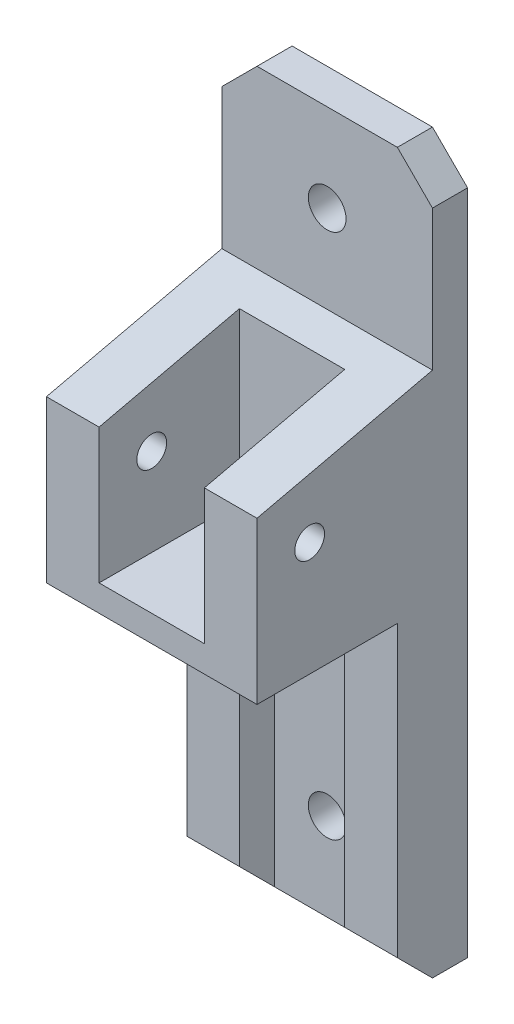
ISO-10303-21;
HEADER;
FILE_DESCRIPTION(('STEP AP214'),'2;1');
FILE_NAME('part.step','',(''),(''),'','','');
FILE_SCHEMA(('AUTOMOTIVE_DESIGN { 1 0 10303 214 1 1 1 1 }'));
ENDSEC;
DATA;
#1=APPLICATION_CONTEXT('core data for automotive mechanical design processes');
#2=APPLICATION_PROTOCOL_DEFINITION('international standard','automotive_design',2000,#1);
#3=PRODUCT_CONTEXT('',#1,'mechanical');
#4=PRODUCT('Part','Part','',(#3));
#5=PRODUCT_RELATED_PRODUCT_CATEGORY('part','',(#4));
#6=PRODUCT_DEFINITION_FORMATION('','',#4);
#7=PRODUCT_DEFINITION_CONTEXT('part definition',#1,'design');
#8=PRODUCT_DEFINITION('design','',#6,#7);
#9=PRODUCT_DEFINITION_SHAPE('','',#8);
#10=(LENGTH_UNIT() NAMED_UNIT(*) SI_UNIT(.MILLI.,.METRE.));
#11=(NAMED_UNIT(*) PLANE_ANGLE_UNIT() SI_UNIT($,.RADIAN.));
#12=(NAMED_UNIT(*) SI_UNIT($,.STERADIAN.) SOLID_ANGLE_UNIT());
#13=UNCERTAINTY_MEASURE_WITH_UNIT(LENGTH_MEASURE(1.E-05),#10,'distance_accuracy_value','');
#14=(GEOMETRIC_REPRESENTATION_CONTEXT(3) GLOBAL_UNCERTAINTY_ASSIGNED_CONTEXT((#13)) GLOBAL_UNIT_ASSIGNED_CONTEXT((#10,
#11,#12)) REPRESENTATION_CONTEXT('',''));
#15=CARTESIAN_POINT('',(0.,0.,0.));
#16=DIRECTION('',(0.,0.,1.));
#17=DIRECTION('',(1.,0.,0.));
#18=AXIS2_PLACEMENT_3D('',#15,#16,#17);
#19=CARTESIAN_POINT('',(12.,10.,18.));
#20=DIRECTION('',(1.,0.,0.));
#21=DIRECTION('',(0.,0.,-1.));
#22=AXIS2_PLACEMENT_3D('',#19,#20,#21);
#23=CYLINDRICAL_SURFACE('',#22,1.69999999999999);
#24=CARTESIAN_POINT('',(-6.,10.,18.));
#25=DIRECTION('',(-1.,0.,0.));
#26=DIRECTION('',(0.,-1.,0.));
#27=AXIS2_PLACEMENT_3D('',#24,#25,#26);
#28=CIRCLE('',#27,1.69999999999999);
#29=CARTESIAN_POINT('',(-6.,8.3,18.));
#30=VERTEX_POINT('',#29);
#31=EDGE_CURVE('E363',#30,#30,#28,.T.);
#32=ORIENTED_EDGE('',*,*,#31,.F.);
#33=EDGE_LOOP('',(#32));
#34=FACE_BOUND('',#33,.T.);
#35=CARTESIAN_POINT('',(-9.,10.,18.));
#36=DIRECTION('',(-1.,0.,0.));
#37=DIRECTION('',(0.,-1.,0.));
#38=AXIS2_PLACEMENT_3D('',#35,#36,#37);
#39=CIRCLE('',#38,1.69999999999999);
#40=CARTESIAN_POINT('',(-9.,8.3,18.));
#41=VERTEX_POINT('',#40);
#42=EDGE_CURVE('E45',#41,#41,#39,.F.);
#43=ORIENTED_EDGE('',*,*,#42,.F.);
#44=EDGE_LOOP('',(#43));
#45=FACE_BOUND('',#44,.T.);
#46=ADVANCED_FACE('F41',(#34,#45),#23,.F.);
#47=CARTESIAN_POINT('',(0.,0.,4.));
#48=DIRECTION('',(0.,0.,1.));
#49=DIRECTION('',(1.,0.,0.));
#50=AXIS2_PLACEMENT_3D('',#47,#48,#49);
#51=PLANE('',#50);
#52=CARTESIAN_POINT('',(0.,-30.,4.));
#53=DIRECTION('',(0.,0.,1.));
#54=DIRECTION('',(1.,0.,0.));
#55=AXIS2_PLACEMENT_3D('',#52,#53,#54);
#56=CIRCLE('',#55,2.14999999999999);
#57=CARTESIAN_POINT('',(2.15,-30.,4.));
#58=VERTEX_POINT('',#57);
#59=EDGE_CURVE('E385',#58,#58,#56,.T.);
#60=ORIENTED_EDGE('',*,*,#59,.F.);
#61=EDGE_LOOP('',(#60));
#62=FACE_BOUND('',#61,.T.);
#63=DIRECTION('',(1.,0.,0.));
#64=VECTOR('',#63,1.);
#65=CARTESIAN_POINT('',(-12.,-40.,4.));
#66=LINE('',#65,#64);
#67=CARTESIAN_POINT('',(-5.99999999999999,-40.,4.));
#68=VERTEX_POINT('',#67);
#69=CARTESIAN_POINT('',(6.,-40.,4.));
#70=VERTEX_POINT('',#69);
#71=EDGE_CURVE('E283',#68,#70,#66,.T.);
#72=ORIENTED_EDGE('',*,*,#71,.T.);
#73=DIRECTION('',(0.,-1.,0.));
#74=VECTOR('',#73,1.);
#75=CARTESIAN_POINT('',(6.,-3.,4.));
#76=LINE('',#75,#74);
#77=CARTESIAN_POINT('',(6.00000000000001,-3.,4.));
#78=VERTEX_POINT('',#77);
#79=EDGE_CURVE('E374',#78,#70,#76,.T.);
#80=ORIENTED_EDGE('',*,*,#79,.F.);
#81=DIRECTION('',(1.,0.,0.));
#82=VECTOR('',#81,1.);
#83=CARTESIAN_POINT('',(-12.,-3.00000000000001,4.));
#84=LINE('',#83,#82);
#85=CARTESIAN_POINT('',(-5.99999999999999,-3.,4.));
#86=VERTEX_POINT('',#85);
#87=EDGE_CURVE('E258',#86,#78,#84,.T.);
#88=ORIENTED_EDGE('',*,*,#87,.F.);
#89=DIRECTION('',(0.,1.,0.));
#90=VECTOR('',#89,1.);
#91=CARTESIAN_POINT('',(-5.99999999999999,-40.,4.));
#92=LINE('',#91,#90);
#93=EDGE_CURVE('E233',#68,#86,#92,.T.);
#94=ORIENTED_EDGE('',*,*,#93,.F.);
#95=EDGE_LOOP('',(#72,#80,#88,#94));
#96=FACE_BOUND('',#95,.T.);
#97=ADVANCED_FACE('F529',(#62,#96),#51,.T.);
#98=CARTESIAN_POINT('',(-12.,-3.00000000000001,8.));
#99=DIRECTION('',(0.,1.,0.));
#100=DIRECTION('',(-1.,0.,0.));
#101=AXIS2_PLACEMENT_3D('',#98,#99,#100);
#102=PLANE('',#101);
#103=DIRECTION('',(0.,0.,-1.));
#104=VECTOR('',#103,1.);
#105=CARTESIAN_POINT('',(6.,-3.,8.));
#106=LINE('',#105,#104);
#107=CARTESIAN_POINT('',(6.00000000000001,-3.,8.));
#108=VERTEX_POINT('',#107);
#109=EDGE_CURVE('E400',#108,#78,#106,.T.);
#110=ORIENTED_EDGE('',*,*,#109,.F.);
#111=DIRECTION('',(-1.,0.,0.));
#112=VECTOR('',#111,1.);
#113=CARTESIAN_POINT('',(12.,-3.,8.));
#114=LINE('',#113,#112);
#115=CARTESIAN_POINT('',(12.,-3.,8.));
#116=VERTEX_POINT('',#115);
#117=EDGE_CURVE('E392',#116,#108,#114,.T.);
#118=ORIENTED_EDGE('',*,*,#117,.F.);
#119=DIRECTION('',(0.,0.,-1.));
#120=VECTOR('',#119,1.);
#121=CARTESIAN_POINT('',(12.,-3.,8.));
#122=LINE('',#121,#120);
#123=CARTESIAN_POINT('',(12.,-3.00000000000001,24.));
#124=VERTEX_POINT('',#123);
#125=EDGE_CURVE('E240',#124,#116,#122,.T.);
#126=ORIENTED_EDGE('',*,*,#125,.F.);
#127=DIRECTION('',(1.,0.,0.));
#128=VECTOR('',#127,1.);
#129=CARTESIAN_POINT('',(12.,-3.00000000000001,24.));
#130=LINE('',#129,#128);
#131=CARTESIAN_POINT('',(-12.,-3.00000000000001,24.));
#132=VERTEX_POINT('',#131);
#133=EDGE_CURVE('E237',#132,#124,#130,.T.);
#134=ORIENTED_EDGE('',*,*,#133,.F.);
#135=DIRECTION('',(0.,0.,-1.));
#136=VECTOR('',#135,1.);
#137=CARTESIAN_POINT('',(-12.,-3.00000000000001,8.));
#138=LINE('',#137,#136);
#139=CARTESIAN_POINT('',(-12.,-3.,8.));
#140=VERTEX_POINT('',#139);
#141=EDGE_CURVE('E214',#132,#140,#138,.T.);
#142=ORIENTED_EDGE('',*,*,#141,.T.);
#143=DIRECTION('',(-1.,0.,0.));
#144=VECTOR('',#143,1.);
#145=CARTESIAN_POINT('',(-5.99999999999999,-3.,8.));
#146=LINE('',#145,#144);
#147=CARTESIAN_POINT('',(-5.99999999999999,-3.00000000000001,8.));
#148=VERTEX_POINT('',#147);
#149=EDGE_CURVE('E224',#148,#140,#146,.T.);
#150=ORIENTED_EDGE('',*,*,#149,.F.);
#151=DIRECTION('',(0.,0.,-1.));
#152=VECTOR('',#151,1.);
#153=CARTESIAN_POINT('',(-5.99999999999999,-3.,8.));
#154=LINE('',#153,#152);
#155=EDGE_CURVE('E347',#148,#86,#154,.T.);
#156=ORIENTED_EDGE('',*,*,#155,.T.);
#157=ORIENTED_EDGE('',*,*,#87,.T.);
#158=EDGE_LOOP('',(#110,#118,#126,#134,#142,#150,#156,#157));
#159=FACE_BOUND('',#158,.T.);
#160=ADVANCED_FACE('F235',(#159),#102,.F.);
#161=CARTESIAN_POINT('',(0.,30.,4.));
#162=DIRECTION('',(0.,0.,1.));
#163=DIRECTION('',(1.,0.,0.));
#164=AXIS2_PLACEMENT_3D('',#161,#162,#163);
#165=CIRCLE('',#164,2.14999999999999);
#166=CARTESIAN_POINT('',(2.14999999999999,30.,4.));
#167=VERTEX_POINT('',#166);
#168=EDGE_CURVE('E824',#167,#167,#165,.T.);
#169=ORIENTED_EDGE('',*,*,#168,.F.);
#170=EDGE_LOOP('',(#169));
#171=FACE_BOUND('',#170,.T.);
#172=DIRECTION('',(0.,1.,0.));
#173=VECTOR('',#172,1.);
#174=CARTESIAN_POINT('',(12.,40.,4.));
#175=LINE('',#174,#173);
#176=CARTESIAN_POINT('',(12.,20.,4.));
#177=VERTEX_POINT('',#176);
#178=CARTESIAN_POINT('',(12.,36.,4.));
#179=VERTEX_POINT('',#178);
#180=EDGE_CURVE('E271',#177,#179,#175,.T.);
#181=ORIENTED_EDGE('',*,*,#180,.T.);
#182=DIRECTION('',(0.707106781186546,-0.707106781186549,0.));
#183=VECTOR('',#182,1.);
#184=CARTESIAN_POINT('',(24.,23.9999999999999,4.));
#185=LINE('',#184,#183);
#186=CARTESIAN_POINT('',(8.00000000000001,40.,4.));
#187=VERTEX_POINT('',#186);
#188=EDGE_CURVE('E308',#179,#187,#185,.F.);
#189=ORIENTED_EDGE('',*,*,#188,.T.);
#190=DIRECTION('',(-1.,0.,0.));
#191=VECTOR('',#190,1.);
#192=CARTESIAN_POINT('',(-12.,40.,4.));
#193=LINE('',#192,#191);
#194=CARTESIAN_POINT('',(-8.,40.,4.));
#195=VERTEX_POINT('',#194);
#196=EDGE_CURVE('E268',#187,#195,#193,.T.);
#197=ORIENTED_EDGE('',*,*,#196,.T.);
#198=DIRECTION('',(0.707106781186549,0.707106781186546,0.));
#199=VECTOR('',#198,1.);
#200=CARTESIAN_POINT('',(-24.,24.0000000000001,4.));
#201=LINE('',#200,#199);
#202=CARTESIAN_POINT('',(-12.,36.,4.));
#203=VERTEX_POINT('',#202);
#204=EDGE_CURVE('E305',#195,#203,#201,.F.);
#205=ORIENTED_EDGE('',*,*,#204,.T.);
#206=DIRECTION('',(0.,-1.,0.));
#207=VECTOR('',#206,1.);
#208=CARTESIAN_POINT('',(-12.,40.,4.));
#209=LINE('',#208,#207);
#210=CARTESIAN_POINT('',(-12.,20.,4.));
#211=VERTEX_POINT('',#210);
#212=EDGE_CURVE('E296',#203,#211,#209,.T.);
#213=ORIENTED_EDGE('',*,*,#212,.T.);
#214=DIRECTION('',(-1.,0.,0.));
#215=VECTOR('',#214,1.);
#216=CARTESIAN_POINT('',(-12.,20.,4.));
#217=LINE('',#216,#215);
#218=EDGE_CURVE('E248',#177,#211,#217,.T.);
#219=ORIENTED_EDGE('',*,*,#218,.F.);
#220=EDGE_LOOP('',(#181,#189,#197,#205,#213,#219));
#221=FACE_BOUND('',#220,.T.);
#222=ADVANCED_FACE('F470',(#171,#221),#51,.T.);
#223=CARTESIAN_POINT('',(12.,40.,4.));
#224=DIRECTION('',(-1.,0.,0.));
#225=DIRECTION('',(0.,-1.,0.));
#226=AXIS2_PLACEMENT_3D('',#223,#224,#225);
#227=PLANE('',#226);
#228=CARTESIAN_POINT('',(12.,10.,18.));
#229=DIRECTION('',(1.,0.,0.));
#230=DIRECTION('',(0.,0.,-1.));
#231=AXIS2_PLACEMENT_3D('',#228,#229,#230);
#232=CIRCLE('',#231,1.7);
#233=CARTESIAN_POINT('',(12.,10.,16.3));
#234=VERTEX_POINT('',#233);
#235=EDGE_CURVE('E367',#234,#234,#232,.T.);
#236=ORIENTED_EDGE('',*,*,#235,.F.);
#237=EDGE_LOOP('',(#236));
#238=FACE_BOUND('',#237,.T.);
#239=ORIENTED_EDGE('',*,*,#180,.F.);
#240=DIRECTION('',(0.,0.224951054343862,-0.974370064785236));
#241=VECTOR('',#240,1.);
#242=CARTESIAN_POINT('',(12.,15.3826361774887,24.));
#243=LINE('',#242,#241);
#244=CARTESIAN_POINT('',(12.,15.3826361774887,24.));
#245=VERTEX_POINT('',#244);
#246=EDGE_CURVE('E350',#177,#245,#243,.F.);
#247=ORIENTED_EDGE('',*,*,#246,.T.);
#248=DIRECTION('',(0.,1.,0.));
#249=VECTOR('',#248,1.);
#250=CARTESIAN_POINT('',(12.,20.,24.));
#251=LINE('',#250,#249);
#252=EDGE_CURVE('E419',#124,#245,#251,.T.);
#253=ORIENTED_EDGE('',*,*,#252,.F.);
#254=ORIENTED_EDGE('',*,*,#125,.T.);
#255=DIRECTION('',(0.,1.,0.));
#256=VECTOR('',#255,1.);
#257=CARTESIAN_POINT('',(12.,-40.,8.));
#258=LINE('',#257,#256);
#259=CARTESIAN_POINT('',(12.,-36.,8.));
#260=VERTEX_POINT('',#259);
#261=EDGE_CURVE('E389',#260,#116,#258,.T.);
#262=ORIENTED_EDGE('',*,*,#261,.F.);
#263=DIRECTION('',(0.,-0.707106781186545,-0.70710678118655));
#264=VECTOR('',#263,1.);
#265=CARTESIAN_POINT('',(12.,-36.,8.));
#266=LINE('',#265,#264);
#267=CARTESIAN_POINT('',(12.,-40.,3.99999999999998));
#268=VERTEX_POINT('',#267);
#269=EDGE_CURVE('E455',#260,#268,#266,.T.);
#270=ORIENTED_EDGE('',*,*,#269,.T.);
#271=DIRECTION('',(0.,0.,-1.));
#272=VECTOR('',#271,1.);
#273=CARTESIAN_POINT('',(12.,-40.,4.));
#274=LINE('',#273,#272);
#275=CARTESIAN_POINT('',(12.,-40.,0.));
#276=VERTEX_POINT('',#275);
#277=EDGE_CURVE('E280',#268,#276,#274,.T.);
#278=ORIENTED_EDGE('',*,*,#277,.T.);
#279=DIRECTION('',(0.,1.,0.));
#280=VECTOR('',#279,1.);
#281=CARTESIAN_POINT('',(12.,40.,0.));
#282=LINE('',#281,#280);
#283=CARTESIAN_POINT('',(12.,36.,0.));
#284=VERTEX_POINT('',#283);
#285=EDGE_CURVE('E239',#276,#284,#282,.T.);
#286=ORIENTED_EDGE('',*,*,#285,.T.);
#287=DIRECTION('',(0.,0.,1.));
#288=VECTOR('',#287,1.);
#289=CARTESIAN_POINT('',(12.,36.,4.));
#290=LINE('',#289,#288);
#291=EDGE_CURVE('E303',#284,#179,#290,.T.);
#292=ORIENTED_EDGE('',*,*,#291,.T.);
#293=EDGE_LOOP('',(#239,#247,#253,#254,#262,#270,#278,#286,#292));
#294=FACE_BOUND('',#293,.T.);
#295=ADVANCED_FACE('F464',(#238,#294),#227,.F.);
#296=CARTESIAN_POINT('',(-12.,40.,4.));
#297=DIRECTION('',(0.,-1.,0.));
#298=DIRECTION('',(0.,0.,-1.));
#299=AXIS2_PLACEMENT_3D('',#296,#297,#298);
#300=PLANE('',#299);
#301=ORIENTED_EDGE('',*,*,#196,.F.);
#302=DIRECTION('',(0.,0.,-1.));
#303=VECTOR('',#302,1.);
#304=CARTESIAN_POINT('',(8.00000000000001,40.,4.));
#305=LINE('',#304,#303);
#306=CARTESIAN_POINT('',(8.00000000000002,40.,0.));
#307=VERTEX_POINT('',#306);
#308=EDGE_CURVE('E446',#187,#307,#305,.T.);
#309=ORIENTED_EDGE('',*,*,#308,.T.);
#310=DIRECTION('',(-1.,0.,0.));
#311=VECTOR('',#310,1.);
#312=CARTESIAN_POINT('',(-12.,40.,0.));
#313=LINE('',#312,#311);
#314=CARTESIAN_POINT('',(-8.,40.,0.));
#315=VERTEX_POINT('',#314);
#316=EDGE_CURVE('E244',#307,#315,#313,.T.);
#317=ORIENTED_EDGE('',*,*,#316,.T.);
#318=DIRECTION('',(0.,0.,1.));
#319=VECTOR('',#318,1.);
#320=CARTESIAN_POINT('',(-8.,40.,4.));
#321=LINE('',#320,#319);
#322=EDGE_CURVE('E279',#315,#195,#321,.T.);
#323=ORIENTED_EDGE('',*,*,#322,.T.);
#324=EDGE_LOOP('',(#301,#309,#317,#323));
#325=FACE_BOUND('',#324,.T.);
#326=ADVANCED_FACE('F477',(#325),#300,.F.);
#327=CARTESIAN_POINT('',(-12.,40.,4.));
#328=DIRECTION('',(1.,0.,0.));
#329=DIRECTION('',(0.,1.,0.));
#330=AXIS2_PLACEMENT_3D('',#327,#328,#329);
#331=PLANE('',#330);
#332=CARTESIAN_POINT('',(-12.,9.99999999999999,18.));
#333=DIRECTION('',(-1.,0.,0.));
#334=DIRECTION('',(0.,-1.,0.));
#335=AXIS2_PLACEMENT_3D('',#332,#333,#334);
#336=CIRCLE('',#335,3.2);
#337=CARTESIAN_POINT('',(-12.,6.8,18.));
#338=VERTEX_POINT('',#337);
#339=EDGE_CURVE('E835',#338,#338,#336,.T.);
#340=ORIENTED_EDGE('',*,*,#339,.F.);
#341=EDGE_LOOP('',(#340));
#342=FACE_BOUND('',#341,.T.);
#343=DIRECTION('',(0.,-1.,0.));
#344=VECTOR('',#343,1.);
#345=CARTESIAN_POINT('',(-12.,-3.00000000000001,24.));
#346=LINE('',#345,#344);
#347=CARTESIAN_POINT('',(-12.,15.3826361774887,24.));
#348=VERTEX_POINT('',#347);
#349=EDGE_CURVE('E413',#348,#132,#346,.T.);
#350=ORIENTED_EDGE('',*,*,#349,.F.);
#351=DIRECTION('',(0.,-0.224951054343862,0.974370064785236));
#352=VECTOR('',#351,1.);
#353=CARTESIAN_POINT('',(-12.,15.3826361774887,24.));
#354=LINE('',#353,#352);
#355=EDGE_CURVE('E51',#348,#211,#354,.F.);
#356=ORIENTED_EDGE('',*,*,#355,.T.);
#357=ORIENTED_EDGE('',*,*,#212,.F.);
#358=DIRECTION('',(0.,0.,-1.));
#359=VECTOR('',#358,1.);
#360=CARTESIAN_POINT('',(-12.,36.,4.));
#361=LINE('',#360,#359);
#362=CARTESIAN_POINT('',(-12.,36.,0.));
#363=VERTEX_POINT('',#362);
#364=EDGE_CURVE('E312',#203,#363,#361,.T.);
#365=ORIENTED_EDGE('',*,*,#364,.T.);
#366=DIRECTION('',(0.,-1.,0.));
#367=VECTOR('',#366,1.);
#368=CARTESIAN_POINT('',(-12.,40.,0.));
#369=LINE('',#368,#367);
#370=CARTESIAN_POINT('',(-12.,-40.,0.));
#371=VERTEX_POINT('',#370);
#372=EDGE_CURVE('E287',#363,#371,#369,.T.);
#373=ORIENTED_EDGE('',*,*,#372,.T.);
#374=DIRECTION('',(0.,0.,-1.));
#375=VECTOR('',#374,1.);
#376=CARTESIAN_POINT('',(-12.,-40.,4.));
#377=LINE('',#376,#375);
#378=CARTESIAN_POINT('',(-12.,-40.,3.99999999999998));
#379=VERTEX_POINT('',#378);
#380=EDGE_CURVE('E276',#379,#371,#377,.T.);
#381=ORIENTED_EDGE('',*,*,#380,.F.);
#382=DIRECTION('',(0.,0.707106781186545,0.70710678118655));
#383=VECTOR('',#382,1.);
#384=CARTESIAN_POINT('',(-12.,-36.,8.));
#385=LINE('',#384,#383);
#386=CARTESIAN_POINT('',(-12.,-36.,8.));
#387=VERTEX_POINT('',#386);
#388=EDGE_CURVE('E218',#379,#387,#385,.T.);
#389=ORIENTED_EDGE('',*,*,#388,.T.);
#390=DIRECTION('',(0.,-1.,0.));
#391=VECTOR('',#390,1.);
#392=CARTESIAN_POINT('',(-12.,-3.,8.));
#393=LINE('',#392,#391);
#394=EDGE_CURVE('E209',#140,#387,#393,.T.);
#395=ORIENTED_EDGE('',*,*,#394,.F.);
#396=ORIENTED_EDGE('',*,*,#141,.F.);
#397=EDGE_LOOP('',(#350,#356,#357,#365,#373,#381,#389,#395,#396));
#398=FACE_BOUND('',#397,.T.);
#399=ADVANCED_FACE('F212',(#342,#398),#331,.F.);
#400=CARTESIAN_POINT('',(-12.,-40.,4.));
#401=DIRECTION('',(0.,1.,0.));
#402=DIRECTION('',(0.,0.,1.));
#403=AXIS2_PLACEMENT_3D('',#400,#401,#402);
#404=PLANE('',#403);
#405=ORIENTED_EDGE('',*,*,#277,.F.);
#406=DIRECTION('',(-1.,0.,0.));
#407=VECTOR('',#406,1.);
#408=CARTESIAN_POINT('',(6.00000000000001,-40.,3.99999999999998));
#409=LINE('',#408,#407);
#410=EDGE_CURVE('E323',#268,#70,#409,.T.);
#411=ORIENTED_EDGE('',*,*,#410,.T.);
#412=ORIENTED_EDGE('',*,*,#71,.F.);
#413=DIRECTION('',(-1.,0.,0.));
#414=VECTOR('',#413,1.);
#415=CARTESIAN_POINT('',(-12.,-40.,3.99999999999998));
#416=LINE('',#415,#414);
#417=EDGE_CURVE('E320',#68,#379,#416,.T.);
#418=ORIENTED_EDGE('',*,*,#417,.T.);
#419=ORIENTED_EDGE('',*,*,#380,.T.);
#420=DIRECTION('',(1.,0.,0.));
#421=VECTOR('',#420,1.);
#422=CARTESIAN_POINT('',(-12.,-40.,0.));
#423=LINE('',#422,#421);
#424=EDGE_CURVE('E275',#371,#276,#423,.T.);
#425=ORIENTED_EDGE('',*,*,#424,.T.);
#426=EDGE_LOOP('',(#405,#411,#412,#418,#419,#425));
#427=FACE_BOUND('',#426,.T.);
#428=ADVANCED_FACE('F525',(#427),#404,.F.);
#429=CARTESIAN_POINT('',(0.,0.,0.));
#430=DIRECTION('',(0.,0.,1.));
#431=DIRECTION('',(1.,0.,0.));
#432=AXIS2_PLACEMENT_3D('',#429,#430,#431);
#433=PLANE('',#432);
#434=CARTESIAN_POINT('',(0.,30.,0.));
#435=DIRECTION('',(0.,0.,1.));
#436=DIRECTION('',(1.,0.,0.));
#437=AXIS2_PLACEMENT_3D('',#434,#435,#436);
#438=CIRCLE('',#437,2.15);
#439=CARTESIAN_POINT('',(2.15,30.,0.));
#440=VERTEX_POINT('',#439);
#441=EDGE_CURVE('E827',#440,#440,#438,.T.);
#442=ORIENTED_EDGE('',*,*,#441,.T.);
#443=EDGE_LOOP('',(#442));
#444=FACE_BOUND('',#443,.T.);
#445=CARTESIAN_POINT('',(0.,-30.,0.));
#446=DIRECTION('',(0.,0.,1.));
#447=DIRECTION('',(1.,0.,0.));
#448=AXIS2_PLACEMENT_3D('',#445,#446,#447);
#449=CIRCLE('',#448,2.15);
#450=CARTESIAN_POINT('',(2.15000000000001,-30.,0.));
#451=VERTEX_POINT('',#450);
#452=EDGE_CURVE('E378',#451,#451,#449,.T.);
#453=ORIENTED_EDGE('',*,*,#452,.T.);
#454=EDGE_LOOP('',(#453));
#455=FACE_BOUND('',#454,.T.);
#456=ORIENTED_EDGE('',*,*,#316,.F.);
#457=DIRECTION('',(-0.707106781186546,0.707106781186549,0.));
#458=VECTOR('',#457,1.);
#459=CARTESIAN_POINT('',(8.00000000000001,40.,0.));
#460=LINE('',#459,#458);
#461=EDGE_CURVE('E453',#307,#284,#460,.F.);
#462=ORIENTED_EDGE('',*,*,#461,.T.);
#463=ORIENTED_EDGE('',*,*,#285,.F.);
#464=ORIENTED_EDGE('',*,*,#424,.F.);
#465=ORIENTED_EDGE('',*,*,#372,.F.);
#466=DIRECTION('',(-0.707106781186549,-0.707106781186546,0.));
#467=VECTOR('',#466,1.);
#468=CARTESIAN_POINT('',(-12.,36.,0.));
#469=LINE('',#468,#467);
#470=EDGE_CURVE('E450',#363,#315,#469,.F.);
#471=ORIENTED_EDGE('',*,*,#470,.T.);
#472=EDGE_LOOP('',(#456,#462,#463,#464,#465,#471));
#473=FACE_BOUND('',#472,.T.);
#474=ADVANCED_FACE('F480',(#444,#455,#473),#433,.F.);
#475=CARTESIAN_POINT('',(0.,0.,8.));
#476=DIRECTION('',(0.,0.,1.));
#477=DIRECTION('',(1.,0.,0.));
#478=AXIS2_PLACEMENT_3D('',#475,#476,#477);
#479=PLANE('',#478);
#480=DIRECTION('',(0.,-1.,0.));
#481=VECTOR('',#480,1.);
#482=CARTESIAN_POINT('',(6.00000000000001,0.,8.));
#483=LINE('',#482,#481);
#484=CARTESIAN_POINT('',(6.00000000000001,19.0765272354977,8.));
#485=VERTEX_POINT('',#484);
#486=CARTESIAN_POINT('',(6.00000000000001,0.,8.));
#487=VERTEX_POINT('',#486);
#488=EDGE_CURVE('E343',#485,#487,#483,.T.);
#489=ORIENTED_EDGE('',*,*,#488,.F.);
#490=DIRECTION('',(1.,0.,0.));
#491=VECTOR('',#490,1.);
#492=CARTESIAN_POINT('',(0.,19.0765272354977,8.));
#493=LINE('',#492,#491);
#494=CARTESIAN_POINT('',(-6.,19.0765272354977,8.));
#495=VERTEX_POINT('',#494);
#496=EDGE_CURVE('E62',#485,#495,#493,.F.);
#497=ORIENTED_EDGE('',*,*,#496,.T.);
#498=DIRECTION('',(0.,1.,0.));
#499=VECTOR('',#498,1.);
#500=CARTESIAN_POINT('',(-6.,20.,8.));
#501=LINE('',#500,#499);
#502=CARTESIAN_POINT('',(-6.,0.,8.));
#503=VERTEX_POINT('',#502);
#504=EDGE_CURVE('E416',#503,#495,#501,.T.);
#505=ORIENTED_EDGE('',*,*,#504,.F.);
#506=DIRECTION('',(-1.,0.,0.));
#507=VECTOR('',#506,1.);
#508=CARTESIAN_POINT('',(-6.,0.,8.));
#509=LINE('',#508,#507);
#510=EDGE_CURVE('E346',#487,#503,#509,.T.);
#511=ORIENTED_EDGE('',*,*,#510,.F.);
#512=EDGE_LOOP('',(#489,#497,#505,#511));
#513=FACE_BOUND('',#512,.T.);
#514=ADVANCED_FACE('F503',(#513),#479,.T.);
#515=CARTESIAN_POINT('',(6.00000000000001,0.,24.));
#516=DIRECTION('',(1.,0.,0.));
#517=DIRECTION('',(0.,0.,-1.));
#518=AXIS2_PLACEMENT_3D('',#515,#516,#517);
#519=PLANE('',#518);
#520=CARTESIAN_POINT('',(6.00000000000001,10.,18.));
#521=DIRECTION('',(1.,0.,0.));
#522=DIRECTION('',(0.,0.,-1.));
#523=AXIS2_PLACEMENT_3D('',#520,#521,#522);
#524=CIRCLE('',#523,1.69999999999999);
#525=CARTESIAN_POINT('',(6.00000000000001,10.,16.3));
#526=VERTEX_POINT('',#525);
#527=EDGE_CURVE('E366',#526,#526,#524,.T.);
#528=ORIENTED_EDGE('',*,*,#527,.T.);
#529=EDGE_LOOP('',(#528));
#530=FACE_BOUND('',#529,.T.);
#531=DIRECTION('',(0.,-1.,0.));
#532=VECTOR('',#531,1.);
#533=CARTESIAN_POINT('',(6.00000000000001,0.,24.));
#534=LINE('',#533,#532);
#535=CARTESIAN_POINT('',(6.00000000000001,15.3826361774887,24.));
#536=VERTEX_POINT('',#535);
#537=CARTESIAN_POINT('',(6.00000000000001,0.,24.));
#538=VERTEX_POINT('',#537);
#539=EDGE_CURVE('E423',#536,#538,#534,.T.);
#540=ORIENTED_EDGE('',*,*,#539,.F.);
#541=DIRECTION('',(0.,-0.224951054343862,0.974370064785236));
#542=VECTOR('',#541,1.);
#543=CARTESIAN_POINT('',(6.00000000000001,15.3826361774887,24.));
#544=LINE('',#543,#542);
#545=EDGE_CURVE('E342',#536,#485,#544,.F.);
#546=ORIENTED_EDGE('',*,*,#545,.T.);
#547=ORIENTED_EDGE('',*,*,#488,.T.);
#548=DIRECTION('',(0.,0.,-1.));
#549=VECTOR('',#548,1.);
#550=CARTESIAN_POINT('',(6.00000000000001,0.,24.));
#551=LINE('',#550,#549);
#552=EDGE_CURVE('E443',#538,#487,#551,.T.);
#553=ORIENTED_EDGE('',*,*,#552,.F.);
#554=EDGE_LOOP('',(#540,#546,#547,#553));
#555=FACE_BOUND('',#554,.T.);
#556=ADVANCED_FACE('F506',(#530,#555),#519,.F.);
#557=CARTESIAN_POINT('',(-6.,0.,24.));
#558=DIRECTION('',(0.,-1.,0.));
#559=DIRECTION('',(0.,0.,-1.));
#560=AXIS2_PLACEMENT_3D('',#557,#558,#559);
#561=PLANE('',#560);
#562=ORIENTED_EDGE('',*,*,#510,.T.);
#563=DIRECTION('',(0.,0.,-1.));
#564=VECTOR('',#563,1.);
#565=CARTESIAN_POINT('',(-6.,0.,24.));
#566=LINE('',#565,#564);
#567=CARTESIAN_POINT('',(-6.,0.,24.));
#568=VERTEX_POINT('',#567);
#569=EDGE_CURVE('E432',#568,#503,#566,.T.);
#570=ORIENTED_EDGE('',*,*,#569,.F.);
#571=DIRECTION('',(-1.,0.,0.));
#572=VECTOR('',#571,1.);
#573=CARTESIAN_POINT('',(-6.,0.,24.));
#574=LINE('',#573,#572);
#575=EDGE_CURVE('E425',#538,#568,#574,.T.);
#576=ORIENTED_EDGE('',*,*,#575,.F.);
#577=ORIENTED_EDGE('',*,*,#552,.T.);
#578=EDGE_LOOP('',(#562,#570,#576,#577));
#579=FACE_BOUND('',#578,.T.);
#580=ADVANCED_FACE('F501',(#579),#561,.F.);
#581=CARTESIAN_POINT('',(-6.,20.,24.));
#582=DIRECTION('',(-1.,0.,0.));
#583=DIRECTION('',(0.,-1.,0.));
#584=AXIS2_PLACEMENT_3D('',#581,#582,#583);
#585=PLANE('',#584);
#586=ORIENTED_EDGE('',*,*,#31,.T.);
#587=EDGE_LOOP('',(#586));
#588=FACE_BOUND('',#587,.T.);
#589=ORIENTED_EDGE('',*,*,#504,.T.);
#590=DIRECTION('',(0.,0.224951054343862,-0.974370064785236));
#591=VECTOR('',#590,1.);
#592=CARTESIAN_POINT('',(-6.,15.3826361774887,24.));
#593=LINE('',#592,#591);
#594=CARTESIAN_POINT('',(-6.,15.3826361774887,24.));
#595=VERTEX_POINT('',#594);
#596=EDGE_CURVE('E11',#495,#595,#593,.F.);
#597=ORIENTED_EDGE('',*,*,#596,.T.);
#598=DIRECTION('',(0.,1.,0.));
#599=VECTOR('',#598,1.);
#600=CARTESIAN_POINT('',(-6.,20.,24.));
#601=LINE('',#600,#599);
#602=EDGE_CURVE('E428',#568,#595,#601,.T.);
#603=ORIENTED_EDGE('',*,*,#602,.F.);
#604=ORIENTED_EDGE('',*,*,#569,.T.);
#605=EDGE_LOOP('',(#589,#597,#603,#604));
#606=FACE_BOUND('',#605,.T.);
#607=ADVANCED_FACE('F500',(#588,#606),#585,.F.);
#608=CARTESIAN_POINT('',(0.,0.,24.));
#609=DIRECTION('',(0.,0.,-1.));
#610=DIRECTION('',(-1.,0.,0.));
#611=AXIS2_PLACEMENT_3D('',#608,#609,#610);
#612=PLANE('',#611);
#613=ORIENTED_EDGE('',*,*,#252,.T.);
#614=DIRECTION('',(-1.,0.,0.));
#615=VECTOR('',#614,1.);
#616=CARTESIAN_POINT('',(0.,15.3826361774887,24.));
#617=LINE('',#616,#615);
#618=EDGE_CURVE('E338',#245,#536,#617,.T.);
#619=ORIENTED_EDGE('',*,*,#618,.T.);
#620=ORIENTED_EDGE('',*,*,#539,.T.);
#621=ORIENTED_EDGE('',*,*,#575,.T.);
#622=ORIENTED_EDGE('',*,*,#602,.T.);
#623=DIRECTION('',(-1.,0.,0.));
#624=VECTOR('',#623,1.);
#625=CARTESIAN_POINT('',(0.,15.3826361774887,24.));
#626=LINE('',#625,#624);
#627=EDGE_CURVE('E335',#595,#348,#626,.T.);
#628=ORIENTED_EDGE('',*,*,#627,.T.);
#629=ORIENTED_EDGE('',*,*,#349,.T.);
#630=ORIENTED_EDGE('',*,*,#133,.T.);
#631=EDGE_LOOP('',(#613,#619,#620,#621,#622,#628,#629,#630));
#632=FACE_BOUND('',#631,.T.);
#633=ADVANCED_FACE('F509',(#632),#612,.F.);
#634=CARTESIAN_POINT('',(-5.99999999999999,-40.,8.));
#635=DIRECTION('',(-1.,0.,0.));
#636=DIRECTION('',(0.,0.,1.));
#637=AXIS2_PLACEMENT_3D('',#634,#635,#636);
#638=PLANE('',#637);
#639=DIRECTION('',(0.,1.,0.));
#640=VECTOR('',#639,1.);
#641=CARTESIAN_POINT('',(-5.99999999999999,-40.,8.));
#642=LINE('',#641,#640);
#643=CARTESIAN_POINT('',(-5.99999999999999,-36.,8.));
#644=VERTEX_POINT('',#643);
#645=EDGE_CURVE('E223',#644,#148,#642,.T.);
#646=ORIENTED_EDGE('',*,*,#645,.F.);
#647=DIRECTION('',(0.,-0.707106781186545,-0.70710678118655));
#648=VECTOR('',#647,1.);
#649=CARTESIAN_POINT('',(-5.99999999999999,-36.,8.));
#650=LINE('',#649,#648);
#651=EDGE_CURVE('E332',#644,#68,#650,.T.);
#652=ORIENTED_EDGE('',*,*,#651,.T.);
#653=ORIENTED_EDGE('',*,*,#93,.T.);
#654=ORIENTED_EDGE('',*,*,#155,.F.);
#655=EDGE_LOOP('',(#646,#652,#653,#654));
#656=FACE_BOUND('',#655,.T.);
#657=ADVANCED_FACE('F532',(#656),#638,.F.);
#658=CARTESIAN_POINT('',(0.,0.,8.));
#659=DIRECTION('',(0.,0.,1.));
#660=DIRECTION('',(1.,0.,0.));
#661=AXIS2_PLACEMENT_3D('',#658,#659,#660);
#662=PLANE('',#661);
#663=ORIENTED_EDGE('',*,*,#394,.T.);
#664=DIRECTION('',(1.,0.,0.));
#665=VECTOR('',#664,1.);
#666=CARTESIAN_POINT('',(-5.99999999999999,-36.,8.));
#667=LINE('',#666,#665);
#668=EDGE_CURVE('E329',#387,#644,#667,.T.);
#669=ORIENTED_EDGE('',*,*,#668,.T.);
#670=ORIENTED_EDGE('',*,*,#645,.T.);
#671=ORIENTED_EDGE('',*,*,#149,.T.);
#672=EDGE_LOOP('',(#663,#669,#670,#671));
#673=FACE_BOUND('',#672,.T.);
#674=ADVANCED_FACE('F227',(#673),#662,.T.);
#675=CARTESIAN_POINT('',(6.,-3.,8.));
#676=DIRECTION('',(1.,0.,0.));
#677=DIRECTION('',(0.,1.,0.));
#678=AXIS2_PLACEMENT_3D('',#675,#676,#677);
#679=PLANE('',#678);
#680=ORIENTED_EDGE('',*,*,#79,.T.);
#681=DIRECTION('',(0.,0.707106781186545,0.70710678118655));
#682=VECTOR('',#681,1.);
#683=CARTESIAN_POINT('',(6.00000000000001,-36.,8.));
#684=LINE('',#683,#682);
#685=CARTESIAN_POINT('',(6.00000000000001,-36.,8.));
#686=VERTEX_POINT('',#685);
#687=EDGE_CURVE('E326',#70,#686,#684,.T.);
#688=ORIENTED_EDGE('',*,*,#687,.T.);
#689=DIRECTION('',(0.,-1.,0.));
#690=VECTOR('',#689,1.);
#691=CARTESIAN_POINT('',(6.,-3.,8.));
#692=LINE('',#691,#690);
#693=EDGE_CURVE('E396',#108,#686,#692,.T.);
#694=ORIENTED_EDGE('',*,*,#693,.F.);
#695=ORIENTED_EDGE('',*,*,#109,.T.);
#696=EDGE_LOOP('',(#680,#688,#694,#695));
#697=FACE_BOUND('',#696,.T.);
#698=ADVANCED_FACE('F518',(#697),#679,.F.);
#699=CARTESIAN_POINT('',(0.,0.,8.));
#700=DIRECTION('',(0.,0.,1.));
#701=DIRECTION('',(1.,0.,0.));
#702=AXIS2_PLACEMENT_3D('',#699,#700,#701);
#703=PLANE('',#702);
#704=ORIENTED_EDGE('',*,*,#693,.T.);
#705=DIRECTION('',(1.,0.,0.));
#706=VECTOR('',#705,1.);
#707=CARTESIAN_POINT('',(12.,-36.,8.));
#708=LINE('',#707,#706);
#709=EDGE_CURVE('E316',#686,#260,#708,.T.);
#710=ORIENTED_EDGE('',*,*,#709,.T.);
#711=ORIENTED_EDGE('',*,*,#261,.T.);
#712=ORIENTED_EDGE('',*,*,#117,.T.);
#713=EDGE_LOOP('',(#704,#710,#711,#712));
#714=FACE_BOUND('',#713,.T.);
#715=ADVANCED_FACE('F515',(#714),#703,.T.);
#716=CARTESIAN_POINT('',(8.00000000000001,40.,4.));
#717=DIRECTION('',(-0.707106781186549,-0.707106781186546,0.));
#718=DIRECTION('',(0.,0.,-1.));
#719=AXIS2_PLACEMENT_3D('',#716,#717,#718);
#720=PLANE('',#719);
#721=ORIENTED_EDGE('',*,*,#188,.F.);
#722=ORIENTED_EDGE('',*,*,#291,.F.);
#723=ORIENTED_EDGE('',*,*,#461,.F.);
#724=ORIENTED_EDGE('',*,*,#308,.F.);
#725=EDGE_LOOP('',(#721,#722,#723,#724));
#726=FACE_BOUND('',#725,.T.);
#727=ADVANCED_FACE('F474',(#726),#720,.F.);
#728=CARTESIAN_POINT('',(-12.,36.,4.));
#729=DIRECTION('',(0.707106781186546,-0.707106781186549,0.));
#730=DIRECTION('',(0.,0.,-1.));
#731=AXIS2_PLACEMENT_3D('',#728,#729,#730);
#732=PLANE('',#731);
#733=ORIENTED_EDGE('',*,*,#204,.F.);
#734=ORIENTED_EDGE('',*,*,#322,.F.);
#735=ORIENTED_EDGE('',*,*,#470,.F.);
#736=ORIENTED_EDGE('',*,*,#364,.F.);
#737=EDGE_LOOP('',(#733,#734,#735,#736));
#738=FACE_BOUND('',#737,.T.);
#739=ADVANCED_FACE('F486',(#738),#732,.F.);
#740=CARTESIAN_POINT('',(0.,-36.,8.));
#741=DIRECTION('',(0.,-0.70710678118655,0.707106781186545));
#742=DIRECTION('',(-1.,0.,0.));
#743=AXIS2_PLACEMENT_3D('',#740,#741,#742);
#744=PLANE('',#743);
#745=ORIENTED_EDGE('',*,*,#687,.F.);
#746=ORIENTED_EDGE('',*,*,#410,.F.);
#747=ORIENTED_EDGE('',*,*,#269,.F.);
#748=ORIENTED_EDGE('',*,*,#709,.F.);
#749=EDGE_LOOP('',(#745,#746,#747,#748));
#750=FACE_BOUND('',#749,.T.);
#751=ADVANCED_FACE('F522',(#750),#744,.T.);
#752=CARTESIAN_POINT('',(0.,-36.,8.));
#753=DIRECTION('',(0.,-0.70710678118655,0.707106781186545));
#754=DIRECTION('',(-1.,0.,0.));
#755=AXIS2_PLACEMENT_3D('',#752,#753,#754);
#756=PLANE('',#755);
#757=ORIENTED_EDGE('',*,*,#388,.F.);
#758=ORIENTED_EDGE('',*,*,#417,.F.);
#759=ORIENTED_EDGE('',*,*,#651,.F.);
#760=ORIENTED_EDGE('',*,*,#668,.F.);
#761=EDGE_LOOP('',(#757,#758,#759,#760));
#762=FACE_BOUND('',#761,.T.);
#763=ADVANCED_FACE('F534',(#762),#756,.T.);
#764=CARTESIAN_POINT('',(0.,15.3826361774887,24.));
#765=DIRECTION('',(0.,-0.974370064785236,-0.224951054343862));
#766=DIRECTION('',(-1.,0.,0.));
#767=AXIS2_PLACEMENT_3D('',#764,#765,#766);
#768=PLANE('',#767);
#769=ORIENTED_EDGE('',*,*,#596,.F.);
#770=ORIENTED_EDGE('',*,*,#496,.F.);
#771=ORIENTED_EDGE('',*,*,#545,.F.);
#772=ORIENTED_EDGE('',*,*,#618,.F.);
#773=ORIENTED_EDGE('',*,*,#246,.F.);
#774=ORIENTED_EDGE('',*,*,#218,.T.);
#775=ORIENTED_EDGE('',*,*,#355,.F.);
#776=ORIENTED_EDGE('',*,*,#627,.F.);
#777=EDGE_LOOP('',(#769,#770,#771,#772,#773,#774,#775,#776));
#778=FACE_BOUND('',#777,.T.);
#779=ADVANCED_FACE('F43',(#778),#768,.F.);
#780=ORIENTED_EDGE('',*,*,#235,.T.);
#781=EDGE_LOOP('',(#780));
#782=FACE_BOUND('',#781,.T.);
#783=ORIENTED_EDGE('',*,*,#527,.F.);
#784=EDGE_LOOP('',(#783));
#785=FACE_BOUND('',#784,.T.);
#786=ADVANCED_FACE('F540',(#782,#785),#23,.F.);
#787=CARTESIAN_POINT('',(0.,-30.,4.));
#788=DIRECTION('',(0.,0.,1.));
#789=DIRECTION('',(1.,0.,0.));
#790=AXIS2_PLACEMENT_3D('',#787,#788,#789);
#791=CYLINDRICAL_SURFACE('',#790,2.14999999999999);
#792=ORIENTED_EDGE('',*,*,#452,.F.);
#793=EDGE_LOOP('',(#792));
#794=FACE_BOUND('',#793,.T.);
#795=ORIENTED_EDGE('',*,*,#59,.T.);
#796=EDGE_LOOP('',(#795));
#797=FACE_BOUND('',#796,.T.);
#798=ADVANCED_FACE('F554',(#794,#797),#791,.F.);
#799=CARTESIAN_POINT('',(0.,30.,4.));
#800=DIRECTION('',(0.,0.,1.));
#801=DIRECTION('',(1.,0.,0.));
#802=AXIS2_PLACEMENT_3D('',#799,#800,#801);
#803=CYLINDRICAL_SURFACE('',#802,2.14999999999999);
#804=ORIENTED_EDGE('',*,*,#441,.F.);
#805=EDGE_LOOP('',(#804));
#806=FACE_BOUND('',#805,.T.);
#807=ORIENTED_EDGE('',*,*,#168,.T.);
#808=EDGE_LOOP('',(#807));
#809=FACE_BOUND('',#808,.T.);
#810=ADVANCED_FACE('F558',(#806,#809),#803,.F.);
#811=CARTESIAN_POINT('',(-9.,9.99999999999999,18.));
#812=DIRECTION('',(-1.,0.,0.));
#813=DIRECTION('',(0.,-1.,0.));
#814=AXIS2_PLACEMENT_3D('',#811,#812,#813);
#815=PLANE('',#814);
#816=CARTESIAN_POINT('',(-9.,9.99999999999999,18.));
#817=DIRECTION('',(-1.,0.,0.));
#818=DIRECTION('',(0.,-1.,0.));
#819=AXIS2_PLACEMENT_3D('',#816,#817,#818);
#820=CIRCLE('',#819,3.2);
#821=CARTESIAN_POINT('',(-9.,6.8,18.));
#822=VERTEX_POINT('',#821);
#823=EDGE_CURVE('E833',#822,#822,#820,.T.);
#824=ORIENTED_EDGE('',*,*,#823,.T.);
#825=EDGE_LOOP('',(#824));
#826=FACE_BOUND('',#825,.T.);
#827=ORIENTED_EDGE('',*,*,#42,.T.);
#828=EDGE_LOOP('',(#827));
#829=FACE_BOUND('',#828,.T.);
#830=ADVANCED_FACE('F605',(#826,#829),#815,.T.);
#831=CARTESIAN_POINT('',(-9.,9.99999999999999,18.));
#832=DIRECTION('',(-1.,0.,0.));
#833=DIRECTION('',(0.,-1.,0.));
#834=AXIS2_PLACEMENT_3D('',#831,#832,#833);
#835=CYLINDRICAL_SURFACE('',#834,3.2);
#836=ORIENTED_EDGE('',*,*,#823,.F.);
#837=EDGE_LOOP('',(#836));
#838=FACE_BOUND('',#837,.T.);
#839=ORIENTED_EDGE('',*,*,#339,.T.);
#840=EDGE_LOOP('',(#839));
#841=FACE_BOUND('',#840,.T.);
#842=ADVANCED_FACE('F635',(#838,#841),#835,.F.);
#843=CLOSED_SHELL('',(#46,#97,#160,#222,#295,#326,#399,#428,#474,#514,#556,#580,#607,#633,#657,
#674,#698,#715,#727,#739,#751,#763,#779,#786,#798,#810,#830,#842));
#844=MANIFOLD_SOLID_BREP('B2',#843);
#845=ADVANCED_BREP_SHAPE_REPRESENTATION('',(#18,#844),#14);
#846=SHAPE_DEFINITION_REPRESENTATION(#9,#845);
ENDSEC;
END-ISO-10303-21;
